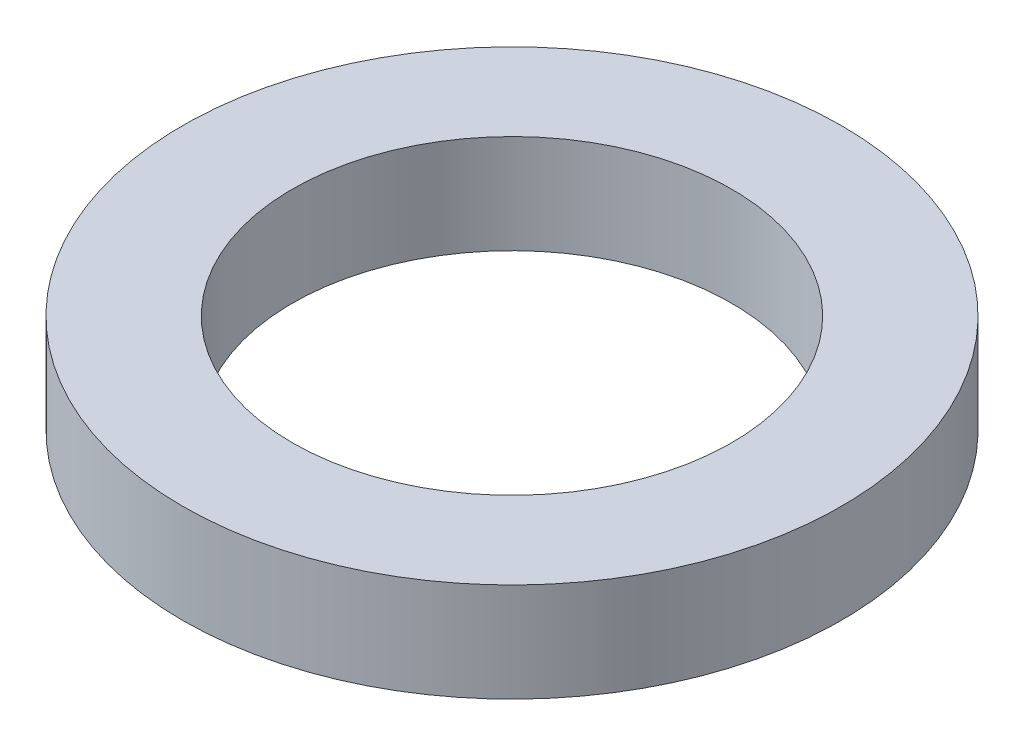
ISO-10303-21;
HEADER;
FILE_DESCRIPTION(('STEP AP214'),'2;1');
FILE_NAME('part.step','',(''),(''),'','','');
FILE_SCHEMA(('AUTOMOTIVE_DESIGN { 1 0 10303 214 1 1 1 1 }'));
ENDSEC;
DATA;
#1=APPLICATION_CONTEXT('core data for automotive mechanical design processes');
#2=APPLICATION_PROTOCOL_DEFINITION('international standard','automotive_design',2000,#1);
#3=PRODUCT_CONTEXT('',#1,'mechanical');
#4=PRODUCT('Part','Part','',(#3));
#5=PRODUCT_RELATED_PRODUCT_CATEGORY('part','',(#4));
#6=PRODUCT_DEFINITION_FORMATION('','',#4);
#7=PRODUCT_DEFINITION_CONTEXT('part definition',#1,'design');
#8=PRODUCT_DEFINITION('design','',#6,#7);
#9=PRODUCT_DEFINITION_SHAPE('','',#8);
#10=(LENGTH_UNIT() NAMED_UNIT(*) SI_UNIT(.MILLI.,.METRE.));
#11=(NAMED_UNIT(*) PLANE_ANGLE_UNIT() SI_UNIT($,.RADIAN.));
#12=(NAMED_UNIT(*) SI_UNIT($,.STERADIAN.) SOLID_ANGLE_UNIT());
#13=UNCERTAINTY_MEASURE_WITH_UNIT(LENGTH_MEASURE(1.E-05),#10,'distance_accuracy_value','');
#14=(GEOMETRIC_REPRESENTATION_CONTEXT(3) GLOBAL_UNCERTAINTY_ASSIGNED_CONTEXT((#13)) GLOBAL_UNIT_ASSIGNED_CONTEXT((#10,
#11,#12)) REPRESENTATION_CONTEXT('',''));
#15=CARTESIAN_POINT('',(0.,0.,0.));
#16=DIRECTION('',(0.,0.,1.));
#17=DIRECTION('',(1.,0.,0.));
#18=AXIS2_PLACEMENT_3D('',#15,#16,#17);
#19=CARTESIAN_POINT('',(0.,9.,0.));
#20=DIRECTION('',(0.,-1.,0.));
#21=DIRECTION('',(0.,0.,-1.));
#22=AXIS2_PLACEMENT_3D('',#19,#20,#21);
#23=CYLINDRICAL_SURFACE('',#22,30.);
#24=CARTESIAN_POINT('',(0.,9.,0.));
#25=DIRECTION('',(0.,1.,0.));
#26=DIRECTION('',(0.,0.,1.));
#27=AXIS2_PLACEMENT_3D('',#24,#25,#26);
#28=CIRCLE('',#27,30.);
#29=CARTESIAN_POINT('',(0.,9.,30.));
#30=VERTEX_POINT('',#29);
#31=EDGE_CURVE('E10',#30,#30,#28,.T.);
#32=ORIENTED_EDGE('',*,*,#31,.F.);
#33=EDGE_LOOP('',(#32));
#34=FACE_BOUND('',#33,.T.);
#35=CARTESIAN_POINT('',(0.,0.,0.));
#36=DIRECTION('',(0.,1.,0.));
#37=DIRECTION('',(0.,0.,1.));
#38=AXIS2_PLACEMENT_3D('',#35,#36,#37);
#39=CIRCLE('',#38,30.);
#40=CARTESIAN_POINT('',(0.,0.,30.));
#41=VERTEX_POINT('',#40);
#42=EDGE_CURVE('E37',#41,#41,#39,.T.);
#43=ORIENTED_EDGE('',*,*,#42,.T.);
#44=EDGE_LOOP('',(#43));
#45=FACE_BOUND('',#44,.T.);
#46=ADVANCED_FACE('F40',(#34,#45),#23,.T.);
#47=CARTESIAN_POINT('',(0.,9.,0.));
#48=DIRECTION('',(0.,1.,0.));
#49=DIRECTION('',(0.,0.,1.));
#50=AXIS2_PLACEMENT_3D('',#47,#48,#49);
#51=PLANE('',#50);
#52=CARTESIAN_POINT('',(0.,9.,0.));
#53=DIRECTION('',(0.,1.,0.));
#54=DIRECTION('',(0.,0.,1.));
#55=AXIS2_PLACEMENT_3D('',#52,#53,#54);
#56=CIRCLE('',#55,20.);
#57=CARTESIAN_POINT('',(0.,9.,20.));
#58=VERTEX_POINT('',#57);
#59=EDGE_CURVE('E50',#58,#58,#56,.T.);
#60=ORIENTED_EDGE('',*,*,#59,.F.);
#61=EDGE_LOOP('',(#60));
#62=FACE_BOUND('',#61,.T.);
#63=ORIENTED_EDGE('',*,*,#31,.T.);
#64=EDGE_LOOP('',(#63));
#65=FACE_BOUND('',#64,.T.);
#66=ADVANCED_FACE('F59',(#62,#65),#51,.T.);
#67=CARTESIAN_POINT('',(0.,0.,0.));
#68=DIRECTION('',(0.,1.,0.));
#69=DIRECTION('',(0.,0.,1.));
#70=AXIS2_PLACEMENT_3D('',#67,#68,#69);
#71=PLANE('',#70);
#72=CARTESIAN_POINT('',(0.,0.,0.));
#73=DIRECTION('',(0.,1.,0.));
#74=DIRECTION('',(0.,0.,1.));
#75=AXIS2_PLACEMENT_3D('',#72,#73,#74);
#76=CIRCLE('',#75,20.);
#77=CARTESIAN_POINT('',(0.,0.,20.));
#78=VERTEX_POINT('',#77);
#79=EDGE_CURVE('E47',#78,#78,#76,.T.);
#80=ORIENTED_EDGE('',*,*,#79,.T.);
#81=EDGE_LOOP('',(#80));
#82=FACE_BOUND('',#81,.T.);
#83=ORIENTED_EDGE('',*,*,#42,.F.);
#84=EDGE_LOOP('',(#83));
#85=FACE_BOUND('',#84,.T.);
#86=ADVANCED_FACE('F58',(#82,#85),#71,.F.);
#87=CARTESIAN_POINT('',(0.,9.,0.));
#88=DIRECTION('',(0.,-1.,0.));
#89=DIRECTION('',(0.,0.,-1.));
#90=AXIS2_PLACEMENT_3D('',#87,#88,#89);
#91=CYLINDRICAL_SURFACE('',#90,20.);
#92=ORIENTED_EDGE('',*,*,#59,.T.);
#93=EDGE_LOOP('',(#92));
#94=FACE_BOUND('',#93,.T.);
#95=ORIENTED_EDGE('',*,*,#79,.F.);
#96=EDGE_LOOP('',(#95));
#97=FACE_BOUND('',#96,.T.);
#98=ADVANCED_FACE('F54',(#94,#97),#91,.F.);
#99=CLOSED_SHELL('',(#46,#66,#86,#98));
#100=MANIFOLD_SOLID_BREP('B2',#99);
#101=ADVANCED_BREP_SHAPE_REPRESENTATION('',(#18,#100),#14);
#102=SHAPE_DEFINITION_REPRESENTATION(#9,#101);
ENDSEC;
END-ISO-10303-21;
